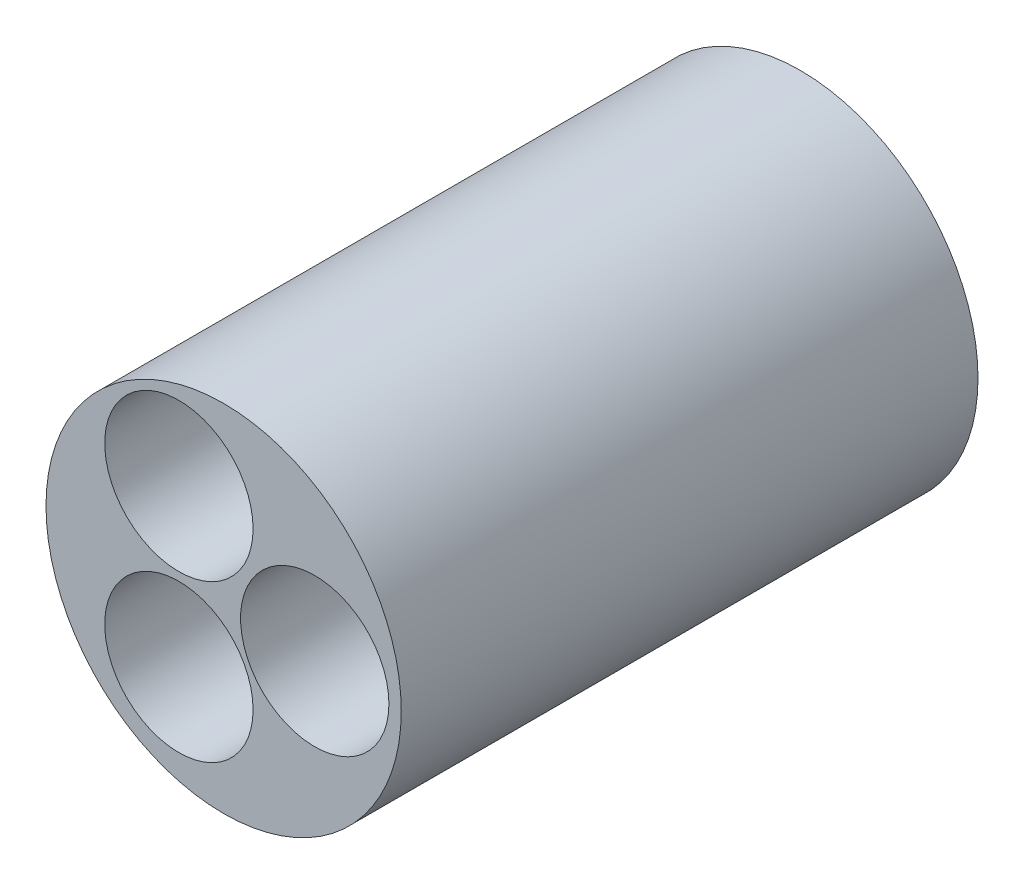
ISO-10303-21;
HEADER;
FILE_DESCRIPTION(('STEP AP214'),'2;1');
FILE_NAME('part.step','',(''),(''),'','','');
FILE_SCHEMA(('AUTOMOTIVE_DESIGN { 1 0 10303 214 1 1 1 1 }'));
ENDSEC;
DATA;
#1=APPLICATION_CONTEXT('core data for automotive mechanical design processes');
#2=APPLICATION_PROTOCOL_DEFINITION('international standard','automotive_design',2000,#1);
#3=PRODUCT_CONTEXT('',#1,'mechanical');
#4=PRODUCT('Part','Part','',(#3));
#5=PRODUCT_RELATED_PRODUCT_CATEGORY('part','',(#4));
#6=PRODUCT_DEFINITION_FORMATION('','',#4);
#7=PRODUCT_DEFINITION_CONTEXT('part definition',#1,'design');
#8=PRODUCT_DEFINITION('design','',#6,#7);
#9=PRODUCT_DEFINITION_SHAPE('','',#8);
#10=(LENGTH_UNIT() NAMED_UNIT(*) SI_UNIT(.MILLI.,.METRE.));
#11=(NAMED_UNIT(*) PLANE_ANGLE_UNIT() SI_UNIT($,.RADIAN.));
#12=(NAMED_UNIT(*) SI_UNIT($,.STERADIAN.) SOLID_ANGLE_UNIT());
#13=UNCERTAINTY_MEASURE_WITH_UNIT(LENGTH_MEASURE(1.E-05),#10,'distance_accuracy_value','');
#14=(GEOMETRIC_REPRESENTATION_CONTEXT(3) GLOBAL_UNCERTAINTY_ASSIGNED_CONTEXT((#13)) GLOBAL_UNIT_ASSIGNED_CONTEXT((#10,
#11,#12)) REPRESENTATION_CONTEXT('',''));
#15=CARTESIAN_POINT('',(0.,0.,0.));
#16=DIRECTION('',(0.,0.,1.));
#17=DIRECTION('',(1.,0.,0.));
#18=AXIS2_PLACEMENT_3D('',#15,#16,#17);
#19=CARTESIAN_POINT('',(5.43696592456946,8.875,70.1));
#20=DIRECTION('',(0.,0.,1.));
#21=DIRECTION('',(1.,0.,0.));
#22=AXIS2_PLACEMENT_3D('',#19,#20,#21);
#23=PLANE('',#22);
#24=CARTESIAN_POINT('',(0.,19.05,70.1));
#25=DIRECTION('',(0.,0.,1.));
#26=DIRECTION('',(1.,0.,0.));
#27=AXIS2_PLACEMENT_3D('',#24,#25,#26);
#28=CIRCLE('',#27,9.017);
#29=CARTESIAN_POINT('',(9.017,19.05,70.1));
#30=VERTEX_POINT('',#29);
#31=EDGE_CURVE('E49',#30,#30,#28,.T.);
#32=ORIENTED_EDGE('',*,*,#31,.F.);
#33=EDGE_LOOP('',(#32));
#34=FACE_BOUND('',#33,.T.);
#35=CARTESIAN_POINT('',(5.43696592456946,8.875,70.1));
#36=DIRECTION('',(0.,0.,1.));
#37=DIRECTION('',(1.,0.,0.));
#38=AXIS2_PLACEMENT_3D('',#35,#36,#37);
#39=CIRCLE('',#38,21.59);
#40=CARTESIAN_POINT('',(27.0269659245695,8.875,70.1));
#41=VERTEX_POINT('',#40);
#42=EDGE_CURVE('E10',#41,#41,#39,.T.);
#43=ORIENTED_EDGE('',*,*,#42,.T.);
#44=EDGE_LOOP('',(#43));
#45=FACE_BOUND('',#44,.T.);
#46=CARTESIAN_POINT('',(0.,0.,70.1));
#47=DIRECTION('',(0.,0.,1.));
#48=DIRECTION('',(1.,0.,0.));
#49=AXIS2_PLACEMENT_3D('',#46,#47,#48);
#50=CIRCLE('',#49,9.017);
#51=CARTESIAN_POINT('',(9.017,0.,70.1));
#52=VERTEX_POINT('',#51);
#53=EDGE_CURVE('E44',#52,#52,#50,.T.);
#54=ORIENTED_EDGE('',*,*,#53,.F.);
#55=EDGE_LOOP('',(#54));
#56=FACE_BOUND('',#55,.T.);
#57=CARTESIAN_POINT('',(16.51,8.875,70.1));
#58=DIRECTION('',(0.,0.,1.));
#59=DIRECTION('',(1.,0.,0.));
#60=AXIS2_PLACEMENT_3D('',#57,#58,#59);
#61=CIRCLE('',#60,9.017);
#62=CARTESIAN_POINT('',(25.527,8.875,70.1));
#63=VERTEX_POINT('',#62);
#64=EDGE_CURVE('E55',#63,#63,#61,.T.);
#65=ORIENTED_EDGE('',*,*,#64,.F.);
#66=EDGE_LOOP('',(#65));
#67=FACE_BOUND('',#66,.T.);
#68=ADVANCED_FACE('F33',(#34,#45,#56,#67),#23,.T.);
#69=CARTESIAN_POINT('',(5.43696592456946,8.875,0.));
#70=DIRECTION('',(0.,0.,1.));
#71=DIRECTION('',(1.,0.,0.));
#72=AXIS2_PLACEMENT_3D('',#69,#70,#71);
#73=PLANE('',#72);
#74=CARTESIAN_POINT('',(5.43696592456946,8.875,0.));
#75=DIRECTION('',(0.,0.,1.));
#76=DIRECTION('',(1.,0.,0.));
#77=AXIS2_PLACEMENT_3D('',#74,#75,#76);
#78=CIRCLE('',#77,21.59);
#79=CARTESIAN_POINT('',(27.0269659245695,8.875,0.));
#80=VERTEX_POINT('',#79);
#81=EDGE_CURVE('E37',#80,#80,#78,.T.);
#82=ORIENTED_EDGE('',*,*,#81,.F.);
#83=EDGE_LOOP('',(#82));
#84=FACE_BOUND('',#83,.T.);
#85=CARTESIAN_POINT('',(0.,0.,0.));
#86=DIRECTION('',(0.,0.,1.));
#87=DIRECTION('',(1.,0.,0.));
#88=AXIS2_PLACEMENT_3D('',#85,#86,#87);
#89=CIRCLE('',#88,9.017);
#90=CARTESIAN_POINT('',(9.017,0.,0.));
#91=VERTEX_POINT('',#90);
#92=EDGE_CURVE('E46',#91,#91,#89,.T.);
#93=ORIENTED_EDGE('',*,*,#92,.T.);
#94=EDGE_LOOP('',(#93));
#95=FACE_BOUND('',#94,.T.);
#96=CARTESIAN_POINT('',(0.,19.05,0.));
#97=DIRECTION('',(0.,0.,1.));
#98=DIRECTION('',(1.,0.,0.));
#99=AXIS2_PLACEMENT_3D('',#96,#97,#98);
#100=CIRCLE('',#99,9.017);
#101=CARTESIAN_POINT('',(9.017,19.05,0.));
#102=VERTEX_POINT('',#101);
#103=EDGE_CURVE('E52',#102,#102,#100,.T.);
#104=ORIENTED_EDGE('',*,*,#103,.T.);
#105=EDGE_LOOP('',(#104));
#106=FACE_BOUND('',#105,.T.);
#107=CARTESIAN_POINT('',(16.51,8.875,0.));
#108=DIRECTION('',(0.,0.,1.));
#109=DIRECTION('',(1.,0.,0.));
#110=AXIS2_PLACEMENT_3D('',#107,#108,#109);
#111=CIRCLE('',#110,9.017);
#112=CARTESIAN_POINT('',(25.527,8.875,0.));
#113=VERTEX_POINT('',#112);
#114=EDGE_CURVE('E58',#113,#113,#111,.T.);
#115=ORIENTED_EDGE('',*,*,#114,.T.);
#116=EDGE_LOOP('',(#115));
#117=FACE_BOUND('',#116,.T.);
#118=ADVANCED_FACE('F68',(#84,#95,#106,#117),#73,.F.);
#119=CARTESIAN_POINT('',(5.43696592456946,8.875,70.1));
#120=DIRECTION('',(0.,0.,-1.));
#121=DIRECTION('',(-1.,0.,0.));
#122=AXIS2_PLACEMENT_3D('',#119,#120,#121);
#123=CYLINDRICAL_SURFACE('',#122,21.59);
#124=ORIENTED_EDGE('',*,*,#42,.F.);
#125=EDGE_LOOP('',(#124));
#126=FACE_BOUND('',#125,.T.);
#127=ORIENTED_EDGE('',*,*,#81,.T.);
#128=EDGE_LOOP('',(#127));
#129=FACE_BOUND('',#128,.T.);
#130=ADVANCED_FACE('F35',(#126,#129),#123,.T.);
#131=CARTESIAN_POINT('',(0.,0.,70.1));
#132=DIRECTION('',(0.,0.,-1.));
#133=DIRECTION('',(-1.,0.,0.));
#134=AXIS2_PLACEMENT_3D('',#131,#132,#133);
#135=CYLINDRICAL_SURFACE('',#134,9.017);
#136=ORIENTED_EDGE('',*,*,#53,.T.);
#137=EDGE_LOOP('',(#136));
#138=FACE_BOUND('',#137,.T.);
#139=ORIENTED_EDGE('',*,*,#92,.F.);
#140=EDGE_LOOP('',(#139));
#141=FACE_BOUND('',#140,.T.);
#142=ADVANCED_FACE('F77',(#138,#141),#135,.F.);
#143=CARTESIAN_POINT('',(0.,19.05,70.1));
#144=DIRECTION('',(0.,0.,-1.));
#145=DIRECTION('',(-1.,0.,0.));
#146=AXIS2_PLACEMENT_3D('',#143,#144,#145);
#147=CYLINDRICAL_SURFACE('',#146,9.017);
#148=ORIENTED_EDGE('',*,*,#31,.T.);
#149=EDGE_LOOP('',(#148));
#150=FACE_BOUND('',#149,.T.);
#151=ORIENTED_EDGE('',*,*,#103,.F.);
#152=EDGE_LOOP('',(#151));
#153=FACE_BOUND('',#152,.T.);
#154=ADVANCED_FACE('F80',(#150,#153),#147,.F.);
#155=CARTESIAN_POINT('',(16.51,8.875,70.1));
#156=DIRECTION('',(0.,0.,-1.));
#157=DIRECTION('',(-1.,0.,0.));
#158=AXIS2_PLACEMENT_3D('',#155,#156,#157);
#159=CYLINDRICAL_SURFACE('',#158,9.017);
#160=ORIENTED_EDGE('',*,*,#64,.T.);
#161=EDGE_LOOP('',(#160));
#162=FACE_BOUND('',#161,.T.);
#163=ORIENTED_EDGE('',*,*,#114,.F.);
#164=EDGE_LOOP('',(#163));
#165=FACE_BOUND('',#164,.T.);
#166=ADVANCED_FACE('F64',(#162,#165),#159,.F.);
#167=CLOSED_SHELL('',(#68,#118,#130,#142,#154,#166));
#168=MANIFOLD_SOLID_BREP('B2',#167);
#169=ADVANCED_BREP_SHAPE_REPRESENTATION('',(#18,#168),#14);
#170=SHAPE_DEFINITION_REPRESENTATION(#9,#169);
ENDSEC;
END-ISO-10303-21;
